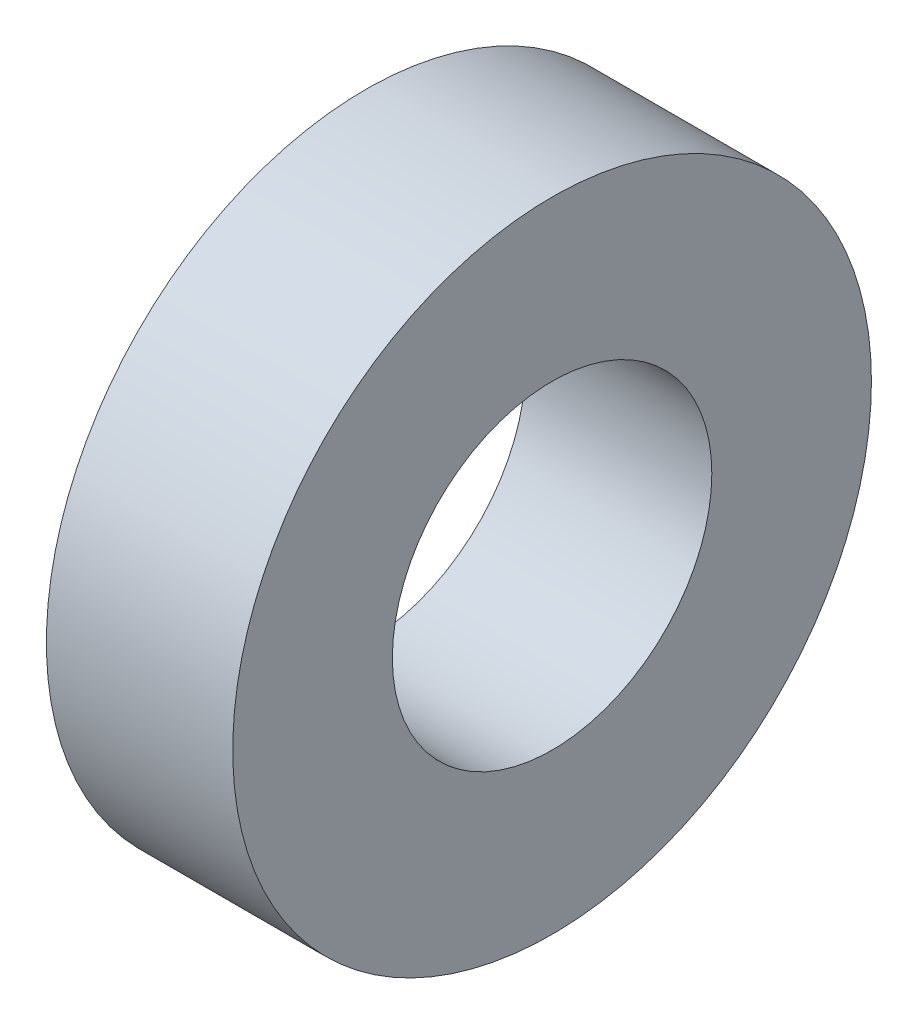
ISO-10303-21;
HEADER;
FILE_DESCRIPTION(('STEP AP214'),'2;1');
FILE_NAME('part.step','',(''),(''),'','','');
FILE_SCHEMA(('AUTOMOTIVE_DESIGN { 1 0 10303 214 1 1 1 1 }'));
ENDSEC;
DATA;
#1=APPLICATION_CONTEXT('core data for automotive mechanical design processes');
#2=APPLICATION_PROTOCOL_DEFINITION('international standard','automotive_design',2000,#1);
#3=PRODUCT_CONTEXT('',#1,'mechanical');
#4=PRODUCT('Part','Part','',(#3));
#5=PRODUCT_RELATED_PRODUCT_CATEGORY('part','',(#4));
#6=PRODUCT_DEFINITION_FORMATION('','',#4);
#7=PRODUCT_DEFINITION_CONTEXT('part definition',#1,'design');
#8=PRODUCT_DEFINITION('design','',#6,#7);
#9=PRODUCT_DEFINITION_SHAPE('','',#8);
#10=(LENGTH_UNIT() NAMED_UNIT(*) SI_UNIT(.MILLI.,.METRE.));
#11=(NAMED_UNIT(*) PLANE_ANGLE_UNIT() SI_UNIT($,.RADIAN.));
#12=(NAMED_UNIT(*) SI_UNIT($,.STERADIAN.) SOLID_ANGLE_UNIT());
#13=UNCERTAINTY_MEASURE_WITH_UNIT(LENGTH_MEASURE(1.E-05),#10,'distance_accuracy_value','');
#14=(GEOMETRIC_REPRESENTATION_CONTEXT(3) GLOBAL_UNCERTAINTY_ASSIGNED_CONTEXT((#13)) GLOBAL_UNIT_ASSIGNED_CONTEXT((#10,
#11,#12)) REPRESENTATION_CONTEXT('',''));
#15=CARTESIAN_POINT('',(0.,0.,0.));
#16=DIRECTION('',(0.,0.,1.));
#17=DIRECTION('',(1.,0.,0.));
#18=AXIS2_PLACEMENT_3D('',#15,#16,#17);
#19=CARTESIAN_POINT('',(35.,0.,0.));
#20=DIRECTION('',(1.,0.,0.));
#21=DIRECTION('',(0.,0.,-1.));
#22=AXIS2_PLACEMENT_3D('',#19,#20,#21);
#23=PLANE('',#22);
#24=CARTESIAN_POINT('',(35.,0.,0.));
#25=DIRECTION('',(1.,0.,0.));
#26=DIRECTION('',(0.,0.,-1.));
#27=AXIS2_PLACEMENT_3D('',#24,#25,#26);
#28=CIRCLE('',#27,59.9781117553695);
#29=CARTESIAN_POINT('',(35.,0.,-59.9781117553695));
#30=VERTEX_POINT('',#29);
#31=EDGE_CURVE('E10',#30,#30,#28,.T.);
#32=ORIENTED_EDGE('',*,*,#31,.T.);
#33=EDGE_LOOP('',(#32));
#34=FACE_BOUND('',#33,.T.);
#35=CARTESIAN_POINT('',(35.,0.,0.));
#36=DIRECTION('',(1.,0.,0.));
#37=DIRECTION('',(0.,0.,-1.));
#38=AXIS2_PLACEMENT_3D('',#35,#36,#37);
#39=CIRCLE('',#38,30.);
#40=CARTESIAN_POINT('',(35.,0.,-30.));
#41=VERTEX_POINT('',#40);
#42=EDGE_CURVE('E46',#41,#41,#39,.T.);
#43=ORIENTED_EDGE('',*,*,#42,.F.);
#44=EDGE_LOOP('',(#43));
#45=FACE_BOUND('',#44,.T.);
#46=ADVANCED_FACE('F35',(#34,#45),#23,.T.);
#47=CARTESIAN_POINT('',(0.,0.,0.));
#48=DIRECTION('',(1.,0.,0.));
#49=DIRECTION('',(0.,0.,-1.));
#50=AXIS2_PLACEMENT_3D('',#47,#48,#49);
#51=PLANE('',#50);
#52=CARTESIAN_POINT('',(0.,0.,0.));
#53=DIRECTION('',(1.,0.,0.));
#54=DIRECTION('',(0.,0.,-1.));
#55=AXIS2_PLACEMENT_3D('',#52,#53,#54);
#56=CIRCLE('',#55,59.9781117553695);
#57=CARTESIAN_POINT('',(0.,0.,-59.9781117553695));
#58=VERTEX_POINT('',#57);
#59=EDGE_CURVE('E39',#58,#58,#56,.T.);
#60=ORIENTED_EDGE('',*,*,#59,.F.);
#61=EDGE_LOOP('',(#60));
#62=FACE_BOUND('',#61,.T.);
#63=CARTESIAN_POINT('',(0.,0.,0.));
#64=DIRECTION('',(1.,0.,0.));
#65=DIRECTION('',(0.,0.,-1.));
#66=AXIS2_PLACEMENT_3D('',#63,#64,#65);
#67=CIRCLE('',#66,30.);
#68=CARTESIAN_POINT('',(0.,0.,-30.));
#69=VERTEX_POINT('',#68);
#70=EDGE_CURVE('E48',#69,#69,#67,.T.);
#71=ORIENTED_EDGE('',*,*,#70,.T.);
#72=EDGE_LOOP('',(#71));
#73=FACE_BOUND('',#72,.T.);
#74=ADVANCED_FACE('F58',(#62,#73),#51,.F.);
#75=CARTESIAN_POINT('',(35.,0.,0.));
#76=DIRECTION('',(-1.,0.,0.));
#77=DIRECTION('',(0.,0.,1.));
#78=AXIS2_PLACEMENT_3D('',#75,#76,#77);
#79=CYLINDRICAL_SURFACE('',#78,59.9781117553695);
#80=ORIENTED_EDGE('',*,*,#31,.F.);
#81=EDGE_LOOP('',(#80));
#82=FACE_BOUND('',#81,.T.);
#83=ORIENTED_EDGE('',*,*,#59,.T.);
#84=EDGE_LOOP('',(#83));
#85=FACE_BOUND('',#84,.T.);
#86=ADVANCED_FACE('F37',(#82,#85),#79,.T.);
#87=CARTESIAN_POINT('',(35.,0.,0.));
#88=DIRECTION('',(-1.,0.,0.));
#89=DIRECTION('',(0.,0.,1.));
#90=AXIS2_PLACEMENT_3D('',#87,#88,#89);
#91=CYLINDRICAL_SURFACE('',#90,30.);
#92=ORIENTED_EDGE('',*,*,#42,.T.);
#93=EDGE_LOOP('',(#92));
#94=FACE_BOUND('',#93,.T.);
#95=ORIENTED_EDGE('',*,*,#70,.F.);
#96=EDGE_LOOP('',(#95));
#97=FACE_BOUND('',#96,.T.);
#98=ADVANCED_FACE('F54',(#94,#97),#91,.F.);
#99=CLOSED_SHELL('',(#46,#74,#86,#98));
#100=MANIFOLD_SOLID_BREP('B2',#99);
#101=ADVANCED_BREP_SHAPE_REPRESENTATION('',(#18,#100),#14);
#102=SHAPE_DEFINITION_REPRESENTATION(#9,#101);
ENDSEC;
END-ISO-10303-21;
